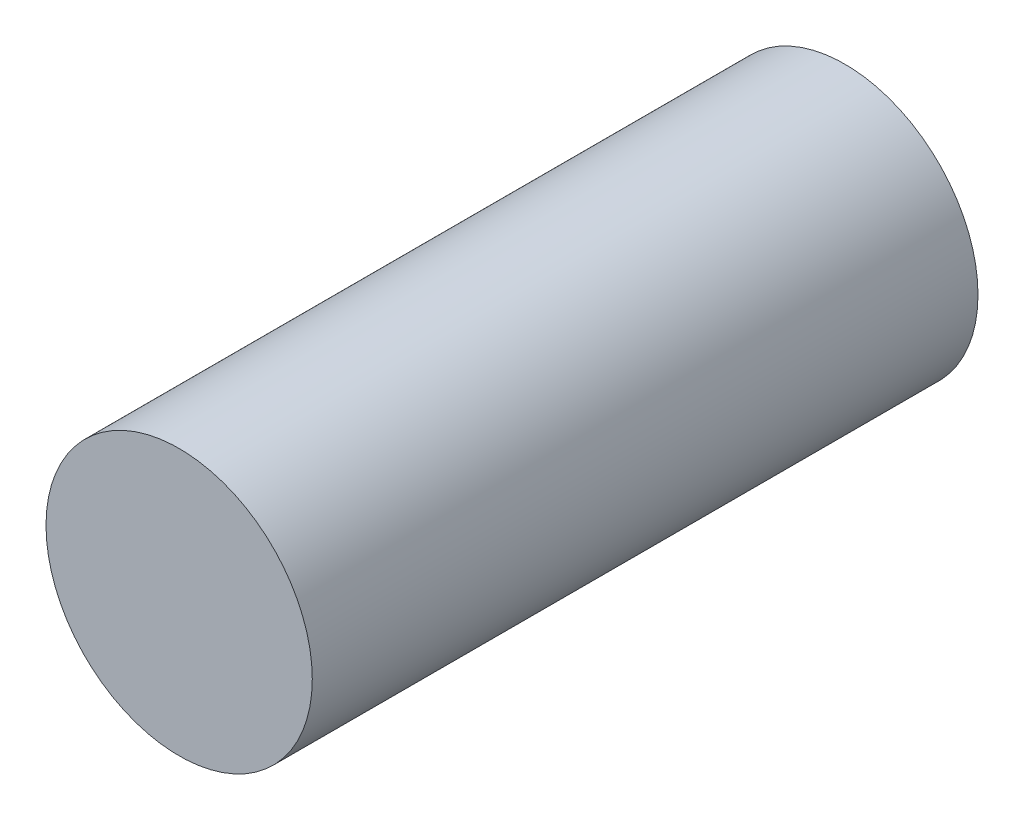
ISO-10303-21;
HEADER;
FILE_DESCRIPTION(('STEP AP214'),'2;1');
FILE_NAME('part.step','',(''),(''),'','','');
FILE_SCHEMA(('AUTOMOTIVE_DESIGN { 1 0 10303 214 1 1 1 1 }'));
ENDSEC;
DATA;
#1=APPLICATION_CONTEXT('core data for automotive mechanical design processes');
#2=APPLICATION_PROTOCOL_DEFINITION('international standard','automotive_design',2000,#1);
#3=PRODUCT_CONTEXT('',#1,'mechanical');
#4=PRODUCT('Part','Part','',(#3));
#5=PRODUCT_RELATED_PRODUCT_CATEGORY('part','',(#4));
#6=PRODUCT_DEFINITION_FORMATION('','',#4);
#7=PRODUCT_DEFINITION_CONTEXT('part definition',#1,'design');
#8=PRODUCT_DEFINITION('design','',#6,#7);
#9=PRODUCT_DEFINITION_SHAPE('','',#8);
#10=(LENGTH_UNIT() NAMED_UNIT(*) SI_UNIT(.MILLI.,.METRE.));
#11=(NAMED_UNIT(*) PLANE_ANGLE_UNIT() SI_UNIT($,.RADIAN.));
#12=(NAMED_UNIT(*) SI_UNIT($,.STERADIAN.) SOLID_ANGLE_UNIT());
#13=UNCERTAINTY_MEASURE_WITH_UNIT(LENGTH_MEASURE(1.E-05),#10,'distance_accuracy_value','');
#14=(GEOMETRIC_REPRESENTATION_CONTEXT(3) GLOBAL_UNCERTAINTY_ASSIGNED_CONTEXT((#13)) GLOBAL_UNIT_ASSIGNED_CONTEXT((#10,
#11,#12)) REPRESENTATION_CONTEXT('',''));
#15=CARTESIAN_POINT('',(0.,0.,0.));
#16=DIRECTION('',(0.,0.,1.));
#17=DIRECTION('',(1.,0.,0.));
#18=AXIS2_PLACEMENT_3D('',#15,#16,#17);
#19=CARTESIAN_POINT('',(0.,0.,127.));
#20=DIRECTION('',(0.,0.,-1.));
#21=DIRECTION('',(-1.,0.,0.));
#22=AXIS2_PLACEMENT_3D('',#19,#20,#21);
#23=CYLINDRICAL_SURFACE('',#22,25.4);
#24=CARTESIAN_POINT('',(0.,0.,127.));
#25=DIRECTION('',(0.,0.,1.));
#26=DIRECTION('',(1.,0.,0.));
#27=AXIS2_PLACEMENT_3D('',#24,#25,#26);
#28=CIRCLE('',#27,25.4);
#29=CARTESIAN_POINT('',(25.4,0.,127.));
#30=VERTEX_POINT('',#29);
#31=EDGE_CURVE('E10',#30,#30,#28,.T.);
#32=ORIENTED_EDGE('',*,*,#31,.F.);
#33=EDGE_LOOP('',(#32));
#34=FACE_BOUND('',#33,.T.);
#35=CARTESIAN_POINT('',(0.,0.,0.));
#36=DIRECTION('',(0.,0.,1.));
#37=DIRECTION('',(1.,0.,0.));
#38=AXIS2_PLACEMENT_3D('',#35,#36,#37);
#39=CIRCLE('',#38,25.4);
#40=CARTESIAN_POINT('',(25.4,0.,0.));
#41=VERTEX_POINT('',#40);
#42=EDGE_CURVE('E32',#41,#41,#39,.T.);
#43=ORIENTED_EDGE('',*,*,#42,.T.);
#44=EDGE_LOOP('',(#43));
#45=FACE_BOUND('',#44,.T.);
#46=ADVANCED_FACE('F29',(#34,#45),#23,.T.);
#47=CARTESIAN_POINT('',(0.,0.,127.));
#48=DIRECTION('',(0.,0.,1.));
#49=DIRECTION('',(1.,0.,0.));
#50=AXIS2_PLACEMENT_3D('',#47,#48,#49);
#51=PLANE('',#50);
#52=ORIENTED_EDGE('',*,*,#31,.T.);
#53=EDGE_LOOP('',(#52));
#54=FACE_BOUND('',#53,.T.);
#55=ADVANCED_FACE('F44',(#54),#51,.T.);
#56=CARTESIAN_POINT('',(0.,0.,0.));
#57=DIRECTION('',(0.,0.,1.));
#58=DIRECTION('',(1.,0.,0.));
#59=AXIS2_PLACEMENT_3D('',#56,#57,#58);
#60=PLANE('',#59);
#61=ORIENTED_EDGE('',*,*,#42,.F.);
#62=EDGE_LOOP('',(#61));
#63=FACE_BOUND('',#62,.T.);
#64=ADVANCED_FACE('F42',(#63),#60,.F.);
#65=CLOSED_SHELL('',(#46,#55,#64));
#66=MANIFOLD_SOLID_BREP('B2',#65);
#67=ADVANCED_BREP_SHAPE_REPRESENTATION('',(#18,#66),#14);
#68=SHAPE_DEFINITION_REPRESENTATION(#9,#67);
ENDSEC;
END-ISO-10303-21;
